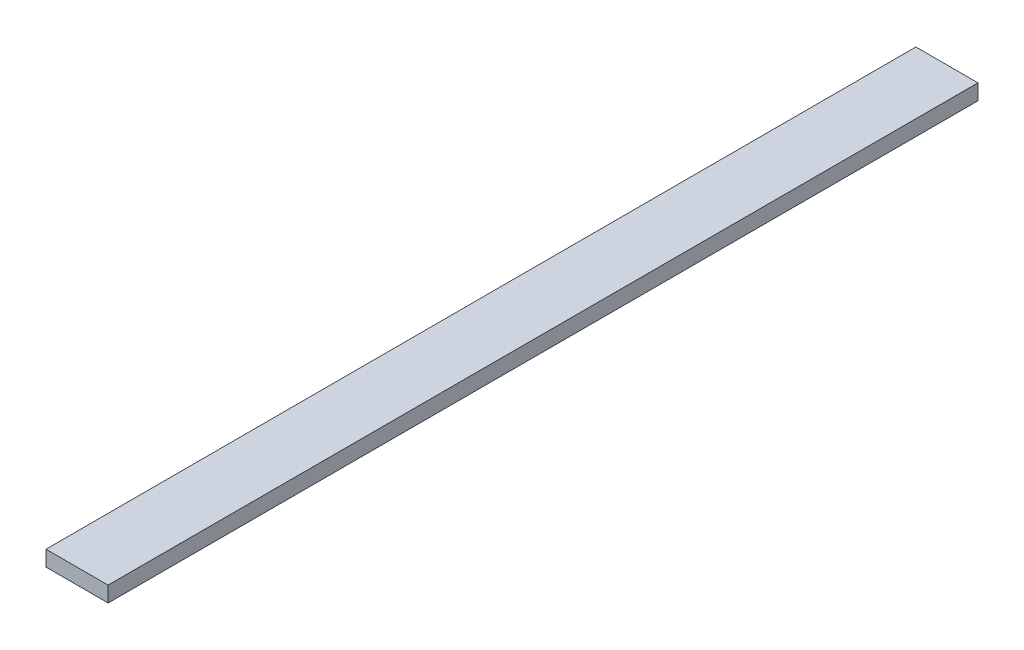
ISO-10303-21;
HEADER;
FILE_DESCRIPTION(('STEP AP214'),'2;1');
FILE_NAME('part.step','',(''),(''),'','','');
FILE_SCHEMA(('AUTOMOTIVE_DESIGN { 1 0 10303 214 1 1 1 1 }'));
ENDSEC;
DATA;
#1=APPLICATION_CONTEXT('core data for automotive mechanical design processes');
#2=APPLICATION_PROTOCOL_DEFINITION('international standard','automotive_design',2000,#1);
#3=PRODUCT_CONTEXT('',#1,'mechanical');
#4=PRODUCT('Part','Part','',(#3));
#5=PRODUCT_RELATED_PRODUCT_CATEGORY('part','',(#4));
#6=PRODUCT_DEFINITION_FORMATION('','',#4);
#7=PRODUCT_DEFINITION_CONTEXT('part definition',#1,'design');
#8=PRODUCT_DEFINITION('design','',#6,#7);
#9=PRODUCT_DEFINITION_SHAPE('','',#8);
#10=(LENGTH_UNIT() NAMED_UNIT(*) SI_UNIT(.MILLI.,.METRE.));
#11=(NAMED_UNIT(*) PLANE_ANGLE_UNIT() SI_UNIT($,.RADIAN.));
#12=(NAMED_UNIT(*) SI_UNIT($,.STERADIAN.) SOLID_ANGLE_UNIT());
#13=UNCERTAINTY_MEASURE_WITH_UNIT(LENGTH_MEASURE(1.E-05),#10,'distance_accuracy_value','');
#14=(GEOMETRIC_REPRESENTATION_CONTEXT(3) GLOBAL_UNCERTAINTY_ASSIGNED_CONTEXT((#13)) GLOBAL_UNIT_ASSIGNED_CONTEXT((#10,
#11,#12)) REPRESENTATION_CONTEXT('',''));
#15=CARTESIAN_POINT('',(0.,0.,0.));
#16=DIRECTION('',(0.,0.,1.));
#17=DIRECTION('',(1.,0.,0.));
#18=AXIS2_PLACEMENT_3D('',#15,#16,#17);
#19=CARTESIAN_POINT('',(0.,6.35,0.));
#20=DIRECTION('',(1.,0.,0.));
#21=DIRECTION('',(0.,0.,-1.));
#22=AXIS2_PLACEMENT_3D('',#19,#20,#21);
#23=PLANE('',#22);
#24=DIRECTION('',(0.,0.,1.));
#25=VECTOR('',#24,1.);
#26=CARTESIAN_POINT('',(0.,0.,0.));
#27=LINE('',#26,#25);
#28=CARTESIAN_POINT('',(0.,0.,-355.6));
#29=VERTEX_POINT('',#28);
#30=CARTESIAN_POINT('',(0.,0.,0.));
#31=VERTEX_POINT('',#30);
#32=EDGE_CURVE('E97',#29,#31,#27,.T.);
#33=ORIENTED_EDGE('',*,*,#32,.T.);
#34=DIRECTION('',(0.,-1.,0.));
#35=VECTOR('',#34,1.);
#36=CARTESIAN_POINT('',(0.,6.35,0.));
#37=LINE('',#36,#35);
#38=CARTESIAN_POINT('',(0.,6.35,0.));
#39=VERTEX_POINT('',#38);
#40=EDGE_CURVE('E11',#39,#31,#37,.T.);
#41=ORIENTED_EDGE('',*,*,#40,.F.);
#42=DIRECTION('',(0.,0.,1.));
#43=VECTOR('',#42,1.);
#44=CARTESIAN_POINT('',(0.,6.35,0.));
#45=LINE('',#44,#43);
#46=CARTESIAN_POINT('',(0.,6.35,-355.6));
#47=VERTEX_POINT('',#46);
#48=EDGE_CURVE('E85',#47,#39,#45,.T.);
#49=ORIENTED_EDGE('',*,*,#48,.F.);
#50=DIRECTION('',(0.,-1.,0.));
#51=VECTOR('',#50,1.);
#52=CARTESIAN_POINT('',(0.,6.35,-355.6));
#53=LINE('',#52,#51);
#54=EDGE_CURVE('E93',#47,#29,#53,.T.);
#55=ORIENTED_EDGE('',*,*,#54,.T.);
#56=EDGE_LOOP('',(#33,#41,#49,#55));
#57=FACE_BOUND('',#56,.T.);
#58=ADVANCED_FACE('F34',(#57),#23,.F.);
#59=CARTESIAN_POINT('',(0.,6.35,0.));
#60=DIRECTION('',(0.,0.,-1.));
#61=DIRECTION('',(-1.,0.,0.));
#62=AXIS2_PLACEMENT_3D('',#59,#60,#61);
#63=PLANE('',#62);
#64=DIRECTION('',(1.,0.,0.));
#65=VECTOR('',#64,1.);
#66=CARTESIAN_POINT('',(0.,0.,0.));
#67=LINE('',#66,#65);
#68=CARTESIAN_POINT('',(25.4,0.,0.));
#69=VERTEX_POINT('',#68);
#70=EDGE_CURVE('E89',#31,#69,#67,.T.);
#71=ORIENTED_EDGE('',*,*,#70,.T.);
#72=DIRECTION('',(0.,-1.,0.));
#73=VECTOR('',#72,1.);
#74=CARTESIAN_POINT('',(25.4,6.35,0.));
#75=LINE('',#74,#73);
#76=CARTESIAN_POINT('',(25.4,6.35,0.));
#77=VERTEX_POINT('',#76);
#78=EDGE_CURVE('E42',#77,#69,#75,.T.);
#79=ORIENTED_EDGE('',*,*,#78,.F.);
#80=DIRECTION('',(1.,0.,0.));
#81=VECTOR('',#80,1.);
#82=CARTESIAN_POINT('',(0.,6.35,0.));
#83=LINE('',#82,#81);
#84=EDGE_CURVE('E80',#39,#77,#83,.T.);
#85=ORIENTED_EDGE('',*,*,#84,.F.);
#86=ORIENTED_EDGE('',*,*,#40,.T.);
#87=EDGE_LOOP('',(#71,#79,#85,#86));
#88=FACE_BOUND('',#87,.T.);
#89=ADVANCED_FACE('F88',(#88),#63,.F.);
#90=CARTESIAN_POINT('',(25.4,6.35,0.));
#91=DIRECTION('',(-1.,0.,0.));
#92=DIRECTION('',(0.,0.,1.));
#93=AXIS2_PLACEMENT_3D('',#90,#91,#92);
#94=PLANE('',#93);
#95=DIRECTION('',(0.,0.,-1.));
#96=VECTOR('',#95,1.);
#97=CARTESIAN_POINT('',(25.4,0.,0.));
#98=LINE('',#97,#96);
#99=CARTESIAN_POINT('',(25.4,0.,-355.6));
#100=VERTEX_POINT('',#99);
#101=EDGE_CURVE('E67',#69,#100,#98,.T.);
#102=ORIENTED_EDGE('',*,*,#101,.T.);
#103=DIRECTION('',(0.,-1.,0.));
#104=VECTOR('',#103,1.);
#105=CARTESIAN_POINT('',(25.4,6.35,-355.6));
#106=LINE('',#105,#104);
#107=CARTESIAN_POINT('',(25.4,6.35,-355.6));
#108=VERTEX_POINT('',#107);
#109=EDGE_CURVE('E90',#108,#100,#106,.T.);
#110=ORIENTED_EDGE('',*,*,#109,.F.);
#111=DIRECTION('',(0.,0.,-1.));
#112=VECTOR('',#111,1.);
#113=CARTESIAN_POINT('',(25.4,6.35,0.));
#114=LINE('',#113,#112);
#115=EDGE_CURVE('E83',#77,#108,#114,.T.);
#116=ORIENTED_EDGE('',*,*,#115,.F.);
#117=ORIENTED_EDGE('',*,*,#78,.T.);
#118=EDGE_LOOP('',(#102,#110,#116,#117));
#119=FACE_BOUND('',#118,.T.);
#120=ADVANCED_FACE('F91',(#119),#94,.F.);
#121=CARTESIAN_POINT('',(0.,6.35,-355.6));
#122=DIRECTION('',(0.,0.,1.));
#123=DIRECTION('',(1.,0.,0.));
#124=AXIS2_PLACEMENT_3D('',#121,#122,#123);
#125=PLANE('',#124);
#126=DIRECTION('',(-1.,0.,0.));
#127=VECTOR('',#126,1.);
#128=CARTESIAN_POINT('',(0.,0.,-355.6));
#129=LINE('',#128,#127);
#130=EDGE_CURVE('E73',#100,#29,#129,.T.);
#131=ORIENTED_EDGE('',*,*,#130,.T.);
#132=ORIENTED_EDGE('',*,*,#54,.F.);
#133=DIRECTION('',(-1.,0.,0.));
#134=VECTOR('',#133,1.);
#135=CARTESIAN_POINT('',(0.,6.35,-355.6));
#136=LINE('',#135,#134);
#137=EDGE_CURVE('E50',#108,#47,#136,.T.);
#138=ORIENTED_EDGE('',*,*,#137,.F.);
#139=ORIENTED_EDGE('',*,*,#109,.T.);
#140=EDGE_LOOP('',(#131,#132,#138,#139));
#141=FACE_BOUND('',#140,.T.);
#142=ADVANCED_FACE('F104',(#141),#125,.F.);
#143=CARTESIAN_POINT('',(0.,6.35,-355.6));
#144=DIRECTION('',(0.,-1.,0.));
#145=DIRECTION('',(0.,0.,-1.));
#146=AXIS2_PLACEMENT_3D('',#143,#144,#145);
#147=PLANE('',#146);
#148=ORIENTED_EDGE('',*,*,#48,.T.);
#149=ORIENTED_EDGE('',*,*,#84,.T.);
#150=ORIENTED_EDGE('',*,*,#115,.T.);
#151=ORIENTED_EDGE('',*,*,#137,.T.);
#152=EDGE_LOOP('',(#148,#149,#150,#151));
#153=FACE_BOUND('',#152,.T.);
#154=ADVANCED_FACE('F81',(#153),#147,.F.);
#155=CARTESIAN_POINT('',(0.,0.,-355.6));
#156=DIRECTION('',(0.,-1.,0.));
#157=DIRECTION('',(0.,0.,-1.));
#158=AXIS2_PLACEMENT_3D('',#155,#156,#157);
#159=PLANE('',#158);
#160=ORIENTED_EDGE('',*,*,#32,.F.);
#161=ORIENTED_EDGE('',*,*,#130,.F.);
#162=ORIENTED_EDGE('',*,*,#101,.F.);
#163=ORIENTED_EDGE('',*,*,#70,.F.);
#164=EDGE_LOOP('',(#160,#161,#162,#163));
#165=FACE_BOUND('',#164,.T.);
#166=ADVANCED_FACE('F107',(#165),#159,.T.);
#167=CLOSED_SHELL('',(#58,#89,#120,#142,#154,#166));
#168=MANIFOLD_SOLID_BREP('B2',#167);
#169=ADVANCED_BREP_SHAPE_REPRESENTATION('',(#18,#168),#14);
#170=SHAPE_DEFINITION_REPRESENTATION(#9,#169);
ENDSEC;
END-ISO-10303-21;
